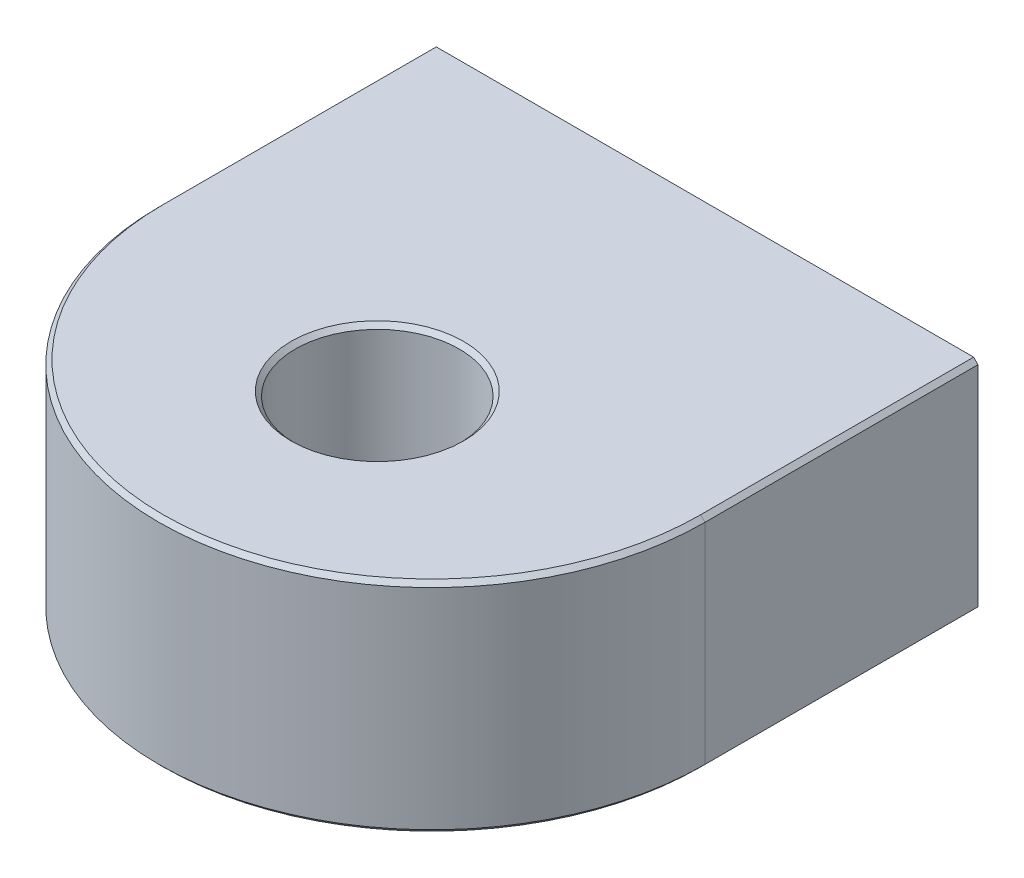
ISO-10303-21;
HEADER;
FILE_DESCRIPTION(('STEP AP214'),'2;1');
FILE_NAME('part.step','',(''),(''),'','','');
FILE_SCHEMA(('AUTOMOTIVE_DESIGN { 1 0 10303 214 1 1 1 1 }'));
ENDSEC;
DATA;
#1=APPLICATION_CONTEXT('core data for automotive mechanical design processes');
#2=APPLICATION_PROTOCOL_DEFINITION('international standard','automotive_design',2000,#1);
#3=PRODUCT_CONTEXT('',#1,'mechanical');
#4=PRODUCT('Part','Part','',(#3));
#5=PRODUCT_RELATED_PRODUCT_CATEGORY('part','',(#4));
#6=PRODUCT_DEFINITION_FORMATION('','',#4);
#7=PRODUCT_DEFINITION_CONTEXT('part definition',#1,'design');
#8=PRODUCT_DEFINITION('design','',#6,#7);
#9=PRODUCT_DEFINITION_SHAPE('','',#8);
#10=(LENGTH_UNIT() NAMED_UNIT(*) SI_UNIT(.MILLI.,.METRE.));
#11=(NAMED_UNIT(*) PLANE_ANGLE_UNIT() SI_UNIT($,.RADIAN.));
#12=(NAMED_UNIT(*) SI_UNIT($,.STERADIAN.) SOLID_ANGLE_UNIT());
#13=UNCERTAINTY_MEASURE_WITH_UNIT(LENGTH_MEASURE(1.E-05),#10,'distance_accuracy_value','');
#14=(GEOMETRIC_REPRESENTATION_CONTEXT(3) GLOBAL_UNCERTAINTY_ASSIGNED_CONTEXT((#13)) GLOBAL_UNIT_ASSIGNED_CONTEXT((#10,
#11,#12)) REPRESENTATION_CONTEXT('',''));
#15=CARTESIAN_POINT('',(0.,0.,0.));
#16=DIRECTION('',(0.,0.,1.));
#17=DIRECTION('',(1.,0.,0.));
#18=AXIS2_PLACEMENT_3D('',#15,#16,#17);
#19=CARTESIAN_POINT('',(15.875,6.35,4.7625));
#20=DIRECTION('',(0.,0.,-1.));
#21=DIRECTION('',(-1.,0.,0.));
#22=AXIS2_PLACEMENT_3D('',#19,#20,#21);
#23=PLANE('',#22);
#24=CARTESIAN_POINT('',(15.875,6.35,4.7625));
#25=DIRECTION('',(0.,0.,-1.));
#26=DIRECTION('',(-1.,0.,0.));
#27=AXIS2_PLACEMENT_3D('',#24,#25,#26);
#28=CIRCLE('',#27,4.7625);
#29=CARTESIAN_POINT('',(11.1125,6.35,4.7625));
#30=VERTEX_POINT('',#29);
#31=EDGE_CURVE('E19',#30,#30,#28,.T.);
#32=ORIENTED_EDGE('',*,*,#31,.T.);
#33=EDGE_LOOP('',(#32));
#34=FACE_BOUND('',#33,.T.);
#35=ADVANCED_FACE('F16',(#34),#23,.T.);
#36=CARTESIAN_POINT('',(5.207,6.35,19.05));
#37=DIRECTION('',(0.,0.,-1.));
#38=DIRECTION('',(-1.,0.,0.));
#39=AXIS2_PLACEMENT_3D('',#36,#37,#38);
#40=PLANE('',#39);
#41=CARTESIAN_POINT('',(5.207,6.35,19.05));
#42=DIRECTION('',(0.,0.,-1.));
#43=DIRECTION('',(-1.,0.,0.));
#44=AXIS2_PLACEMENT_3D('',#41,#42,#43);
#45=CIRCLE('',#44,2.0193);
#46=CARTESIAN_POINT('',(3.18769999999999,6.35,19.05));
#47=VERTEX_POINT('',#46);
#48=EDGE_CURVE('E123',#47,#47,#45,.T.);
#49=ORIENTED_EDGE('',*,*,#48,.T.);
#50=EDGE_LOOP('',(#49));
#51=FACE_BOUND('',#50,.T.);
#52=ADVANCED_FACE('F202',(#51),#40,.T.);
#53=CARTESIAN_POINT('',(26.543,6.35,19.05));
#54=DIRECTION('',(0.,0.,-1.));
#55=DIRECTION('',(-1.,0.,0.));
#56=AXIS2_PLACEMENT_3D('',#53,#54,#55);
#57=PLANE('',#56);
#58=CARTESIAN_POINT('',(26.543,6.35,19.05));
#59=DIRECTION('',(0.,0.,-1.));
#60=DIRECTION('',(-1.,0.,0.));
#61=AXIS2_PLACEMENT_3D('',#58,#59,#60);
#62=CIRCLE('',#61,2.0193);
#63=CARTESIAN_POINT('',(24.5237,6.35,19.05));
#64=VERTEX_POINT('',#63);
#65=EDGE_CURVE('E73',#64,#64,#62,.T.);
#66=ORIENTED_EDGE('',*,*,#65,.T.);
#67=EDGE_LOOP('',(#66));
#68=FACE_BOUND('',#67,.T.);
#69=ADVANCED_FACE('F199',(#68),#57,.T.);
#70=CARTESIAN_POINT('',(15.875,12.6999999999953,19.05));
#71=DIRECTION('',(0.,1.,0.));
#72=DIRECTION('',(0.,0.,1.));
#73=AXIS2_PLACEMENT_3D('',#70,#71,#72);
#74=CONICAL_SURFACE('',#73,5.0164999999467,0.785398163397448);
#75=CARTESIAN_POINT('',(15.875,12.6999999999953,19.05));
#76=DIRECTION('',(0.,1.,0.));
#77=DIRECTION('',(0.,0.,1.));
#78=AXIS2_PLACEMENT_3D('',#75,#76,#77);
#79=CIRCLE('',#78,5.0164999999467);
#80=CARTESIAN_POINT('',(15.875,12.6999999999953,24.0664999999467));
#81=VERTEX_POINT('',#80);
#82=EDGE_CURVE('E118',#81,#81,#79,.T.);
#83=ORIENTED_EDGE('',*,*,#82,.T.);
#84=EDGE_LOOP('',(#83));
#85=FACE_BOUND('',#84,.T.);
#86=CARTESIAN_POINT('',(15.875,12.446,19.05));
#87=DIRECTION('',(0.,1.,0.));
#88=DIRECTION('',(0.,0.,1.));
#89=AXIS2_PLACEMENT_3D('',#86,#87,#88);
#90=CIRCLE('',#89,4.7625);
#91=CARTESIAN_POINT('',(15.875,12.446,23.8125));
#92=VERTEX_POINT('',#91);
#93=EDGE_CURVE('E97',#92,#92,#90,.F.);
#94=ORIENTED_EDGE('',*,*,#93,.T.);
#95=EDGE_LOOP('',(#94));
#96=FACE_BOUND('',#95,.T.);
#97=ADVANCED_FACE('F201',(#85,#96),#74,.F.);
#98=CARTESIAN_POINT('',(31.75,12.446,0.));
#99=DIRECTION('',(0.707106781186557,0.707106781186538,0.));
#100=DIRECTION('',(-0.707106781186538,0.707106781186557,0.));
#101=AXIS2_PLACEMENT_3D('',#98,#99,#100);
#102=PLANE('',#101);
#103=DIRECTION('',(-0.707106781186538,0.707106781186557,0.));
#104=VECTOR('',#103,1.);
#105=CARTESIAN_POINT('',(31.496,12.7,15.875));
#106=LINE('',#105,#104);
#107=CARTESIAN_POINT('',(31.75,12.446,15.875));
#108=VERTEX_POINT('',#107);
#109=CARTESIAN_POINT('',(31.496,12.7,15.875));
#110=VERTEX_POINT('',#109);
#111=EDGE_CURVE('E69',#108,#110,#106,.T.);
#112=ORIENTED_EDGE('',*,*,#111,.F.);
#113=DIRECTION('',(0.,0.,-1.));
#114=VECTOR('',#113,1.);
#115=CARTESIAN_POINT('',(31.75,12.446,0.));
#116=LINE('',#115,#114);
#117=CARTESIAN_POINT('',(31.75,12.446,0.));
#118=VERTEX_POINT('',#117);
#119=EDGE_CURVE('E120',#118,#108,#116,.F.);
#120=ORIENTED_EDGE('',*,*,#119,.F.);
#121=DIRECTION('',(-0.707106781186538,0.707106781186557,0.));
#122=VECTOR('',#121,1.);
#123=CARTESIAN_POINT('',(31.75,12.446,0.));
#124=LINE('',#123,#122);
#125=CARTESIAN_POINT('',(31.496,12.7,0.));
#126=VERTEX_POINT('',#125);
#127=EDGE_CURVE('E72',#118,#126,#124,.T.);
#128=ORIENTED_EDGE('',*,*,#127,.T.);
#129=DIRECTION('',(0.,0.,-1.));
#130=VECTOR('',#129,1.);
#131=CARTESIAN_POINT('',(31.496,12.7,0.));
#132=LINE('',#131,#130);
#133=EDGE_CURVE('E59',#126,#110,#132,.F.);
#134=ORIENTED_EDGE('',*,*,#133,.T.);
#135=EDGE_LOOP('',(#112,#120,#128,#134));
#136=FACE_BOUND('',#135,.T.);
#137=ADVANCED_FACE('F67',(#136),#102,.T.);
#138=CARTESIAN_POINT('',(15.875,12.446,15.875));
#139=DIRECTION('',(0.,-1.,0.));
#140=DIRECTION('',(0.,0.,-1.));
#141=AXIS2_PLACEMENT_3D('',#138,#139,#140);
#142=CONICAL_SURFACE('',#141,15.875,0.785398163397442);
#143=DIRECTION('',(-0.707106781186541,-0.707106781186554,0.));
#144=VECTOR('',#143,1.);
#145=CARTESIAN_POINT('',(0.,12.446,15.875));
#146=LINE('',#145,#144);
#147=CARTESIAN_POINT('',(0.,12.446,15.875));
#148=VERTEX_POINT('',#147);
#149=CARTESIAN_POINT('',(0.253999999999989,12.7,15.875));
#150=VERTEX_POINT('',#149);
#151=EDGE_CURVE('E78',#148,#150,#146,.F.);
#152=ORIENTED_EDGE('',*,*,#151,.F.);
#153=CARTESIAN_POINT('',(15.875,12.446,15.875));
#154=DIRECTION('',(0.,-1.,0.));
#155=DIRECTION('',(0.,0.,-1.));
#156=AXIS2_PLACEMENT_3D('',#153,#154,#155);
#157=CIRCLE('',#156,15.875);
#158=EDGE_CURVE('E77',#108,#148,#157,.T.);
#159=ORIENTED_EDGE('',*,*,#158,.F.);
#160=ORIENTED_EDGE('',*,*,#111,.T.);
#161=CARTESIAN_POINT('',(15.875,12.7,15.875));
#162=DIRECTION('',(0.,-1.,0.));
#163=DIRECTION('',(0.,0.,-1.));
#164=AXIS2_PLACEMENT_3D('',#161,#162,#163);
#165=CIRCLE('',#164,15.621);
#166=EDGE_CURVE('E47',#110,#150,#165,.T.);
#167=ORIENTED_EDGE('',*,*,#166,.T.);
#168=EDGE_LOOP('',(#152,#159,#160,#167));
#169=FACE_BOUND('',#168,.T.);
#170=ADVANCED_FACE('F75',(#169),#142,.T.);
#171=CARTESIAN_POINT('',(0.,12.446,31.75));
#172=DIRECTION('',(-0.707106781186554,0.707106781186541,0.));
#173=DIRECTION('',(-0.707106781186541,-0.707106781186554,0.));
#174=AXIS2_PLACEMENT_3D('',#171,#172,#173);
#175=PLANE('',#174);
#176=DIRECTION('',(-0.707106781186541,-0.707106781186554,0.));
#177=VECTOR('',#176,1.);
#178=CARTESIAN_POINT('',(0.,12.446,0.));
#179=LINE('',#178,#177);
#180=CARTESIAN_POINT('',(0.253999999999991,12.7,0.));
#181=VERTEX_POINT('',#180);
#182=CARTESIAN_POINT('',(0.,12.446,0.));
#183=VERTEX_POINT('',#182);
#184=EDGE_CURVE('E80',#181,#183,#179,.T.);
#185=ORIENTED_EDGE('',*,*,#184,.T.);
#186=DIRECTION('',(0.,0.,1.));
#187=VECTOR('',#186,1.);
#188=CARTESIAN_POINT('',(0.,12.446,31.75));
#189=LINE('',#188,#187);
#190=EDGE_CURVE('E224',#148,#183,#189,.F.);
#191=ORIENTED_EDGE('',*,*,#190,.F.);
#192=ORIENTED_EDGE('',*,*,#151,.T.);
#193=DIRECTION('',(0.,0.,-1.));
#194=VECTOR('',#193,1.);
#195=CARTESIAN_POINT('',(0.253999999999991,12.7,0.));
#196=LINE('',#195,#194);
#197=EDGE_CURVE('E62',#150,#181,#196,.T.);
#198=ORIENTED_EDGE('',*,*,#197,.T.);
#199=EDGE_LOOP('',(#185,#191,#192,#198));
#200=FACE_BOUND('',#199,.T.);
#201=ADVANCED_FACE('F145',(#200),#175,.T.);
#202=CARTESIAN_POINT('',(15.875,0.,19.05));
#203=DIRECTION('',(0.,1.,0.));
#204=DIRECTION('',(0.,0.,1.));
#205=AXIS2_PLACEMENT_3D('',#202,#203,#204);
#206=CYLINDRICAL_SURFACE('',#205,4.7625);
#207=CARTESIAN_POINT('',(15.875,0.253999999983989,19.05));
#208=DIRECTION('',(0.,-1.,0.));
#209=DIRECTION('',(0.,0.,-1.));
#210=AXIS2_PLACEMENT_3D('',#207,#208,#209);
#211=CIRCLE('',#210,4.76250000003374);
#212=CARTESIAN_POINT('',(15.875,0.253999999983989,14.2874999999663));
#213=VERTEX_POINT('',#212);
#214=EDGE_CURVE('E117',#213,#213,#211,.T.);
#215=ORIENTED_EDGE('',*,*,#214,.T.);
#216=EDGE_LOOP('',(#215));
#217=FACE_BOUND('',#216,.T.);
#218=ORIENTED_EDGE('',*,*,#93,.F.);
#219=EDGE_LOOP('',(#218));
#220=FACE_BOUND('',#219,.T.);
#221=ADVANCED_FACE('F134',(#217,#220),#206,.F.);
#222=CARTESIAN_POINT('',(15.875,6.35,4.7625));
#223=DIRECTION('',(0.,0.,-1.));
#224=DIRECTION('',(-1.,0.,0.));
#225=AXIS2_PLACEMENT_3D('',#222,#223,#224);
#226=CYLINDRICAL_SURFACE('',#225,4.7625);
#227=CARTESIAN_POINT('',(15.875,6.35,0.));
#228=DIRECTION('',(0.,0.,-1.));
#229=DIRECTION('',(-1.,0.,0.));
#230=AXIS2_PLACEMENT_3D('',#227,#228,#229);
#231=CIRCLE('',#230,4.7625);
#232=CARTESIAN_POINT('',(11.1125,6.35,0.));
#233=VERTEX_POINT('',#232);
#234=EDGE_CURVE('E114',#233,#233,#231,.F.);
#235=ORIENTED_EDGE('',*,*,#234,.F.);
#236=EDGE_LOOP('',(#235));
#237=FACE_BOUND('',#236,.T.);
#238=ORIENTED_EDGE('',*,*,#31,.F.);
#239=EDGE_LOOP('',(#238));
#240=FACE_BOUND('',#239,.T.);
#241=ADVANCED_FACE('F131',(#237,#240),#226,.F.);
#242=CARTESIAN_POINT('',(5.207,6.35,19.05));
#243=DIRECTION('',(0.,0.,-1.));
#244=DIRECTION('',(-1.,0.,0.));
#245=AXIS2_PLACEMENT_3D('',#242,#243,#244);
#246=CYLINDRICAL_SURFACE('',#245,2.0193);
#247=CARTESIAN_POINT('',(5.207,6.35,0.));
#248=DIRECTION('',(0.,0.,-1.));
#249=DIRECTION('',(-1.,0.,0.));
#250=AXIS2_PLACEMENT_3D('',#247,#248,#249);
#251=CIRCLE('',#250,2.0193);
#252=CARTESIAN_POINT('',(3.18769999999999,6.35,0.));
#253=VERTEX_POINT('',#252);
#254=EDGE_CURVE('E111',#253,#253,#251,.F.);
#255=ORIENTED_EDGE('',*,*,#254,.F.);
#256=EDGE_LOOP('',(#255));
#257=FACE_BOUND('',#256,.T.);
#258=ORIENTED_EDGE('',*,*,#48,.F.);
#259=EDGE_LOOP('',(#258));
#260=FACE_BOUND('',#259,.T.);
#261=ADVANCED_FACE('F133',(#257,#260),#246,.F.);
#262=CARTESIAN_POINT('',(26.543,6.35,19.05));
#263=DIRECTION('',(0.,0.,-1.));
#264=DIRECTION('',(-1.,0.,0.));
#265=AXIS2_PLACEMENT_3D('',#262,#263,#264);
#266=CYLINDRICAL_SURFACE('',#265,2.0193);
#267=CARTESIAN_POINT('',(26.543,6.35,0.));
#268=DIRECTION('',(0.,0.,-1.));
#269=DIRECTION('',(-1.,0.,0.));
#270=AXIS2_PLACEMENT_3D('',#267,#268,#269);
#271=CIRCLE('',#270,2.0193);
#272=CARTESIAN_POINT('',(24.5237,6.35,0.));
#273=VERTEX_POINT('',#272);
#274=EDGE_CURVE('E107',#273,#273,#271,.F.);
#275=ORIENTED_EDGE('',*,*,#274,.F.);
#276=EDGE_LOOP('',(#275));
#277=FACE_BOUND('',#276,.T.);
#278=ORIENTED_EDGE('',*,*,#65,.F.);
#279=EDGE_LOOP('',(#278));
#280=FACE_BOUND('',#279,.T.);
#281=ADVANCED_FACE('F142',(#277,#280),#266,.F.);
#282=CARTESIAN_POINT('',(0.,12.7,0.));
#283=DIRECTION('',(0.,-1.,0.));
#284=DIRECTION('',(0.,0.,-1.));
#285=AXIS2_PLACEMENT_3D('',#282,#283,#284);
#286=PLANE('',#285);
#287=ORIENTED_EDGE('',*,*,#82,.F.);
#288=EDGE_LOOP('',(#287));
#289=FACE_BOUND('',#288,.T.);
#290=ORIENTED_EDGE('',*,*,#197,.F.);
#291=ORIENTED_EDGE('',*,*,#166,.F.);
#292=ORIENTED_EDGE('',*,*,#133,.F.);
#293=DIRECTION('',(-1.,0.,0.));
#294=VECTOR('',#293,1.);
#295=CARTESIAN_POINT('',(0.,12.7,0.));
#296=LINE('',#295,#294);
#297=EDGE_CURVE('E91',#181,#126,#296,.F.);
#298=ORIENTED_EDGE('',*,*,#297,.F.);
#299=EDGE_LOOP('',(#290,#291,#292,#298));
#300=FACE_BOUND('',#299,.T.);
#301=ADVANCED_FACE('F56',(#289,#300),#286,.F.);
#302=CARTESIAN_POINT('',(31.75,12.7,0.));
#303=DIRECTION('',(1.,0.,0.));
#304=DIRECTION('',(0.,0.,-1.));
#305=AXIS2_PLACEMENT_3D('',#302,#303,#304);
#306=PLANE('',#305);
#307=DIRECTION('',(0.,1.,0.));
#308=VECTOR('',#307,1.);
#309=CARTESIAN_POINT('',(31.75,12.7,0.));
#310=LINE('',#309,#308);
#311=CARTESIAN_POINT('',(31.75,0.254000000000004,0.));
#312=VERTEX_POINT('',#311);
#313=EDGE_CURVE('E110',#118,#312,#310,.F.);
#314=ORIENTED_EDGE('',*,*,#313,.F.);
#315=ORIENTED_EDGE('',*,*,#119,.T.);
#316=DIRECTION('',(0.,-1.,0.));
#317=VECTOR('',#316,1.);
#318=CARTESIAN_POINT('',(31.75,12.7,15.875));
#319=LINE('',#318,#317);
#320=CARTESIAN_POINT('',(31.75,0.254000000000004,15.875));
#321=VERTEX_POINT('',#320);
#322=EDGE_CURVE('E264',#321,#108,#319,.F.);
#323=ORIENTED_EDGE('',*,*,#322,.F.);
#324=DIRECTION('',(0.,0.,1.));
#325=VECTOR('',#324,1.);
#326=CARTESIAN_POINT('',(31.75,0.254000000000004,0.));
#327=LINE('',#326,#325);
#328=EDGE_CURVE('E93',#321,#312,#327,.F.);
#329=ORIENTED_EDGE('',*,*,#328,.T.);
#330=EDGE_LOOP('',(#314,#315,#323,#329));
#331=FACE_BOUND('',#330,.T.);
#332=ADVANCED_FACE('F183',(#331),#306,.T.);
#333=CARTESIAN_POINT('',(15.875,12.7,15.875));
#334=DIRECTION('',(0.,-1.,0.));
#335=DIRECTION('',(0.,0.,-1.));
#336=AXIS2_PLACEMENT_3D('',#333,#334,#335);
#337=CYLINDRICAL_SURFACE('',#336,15.875);
#338=CARTESIAN_POINT('',(15.875,0.254000000000003,15.875));
#339=DIRECTION('',(0.,1.,0.));
#340=DIRECTION('',(0.,0.,1.));
#341=AXIS2_PLACEMENT_3D('',#338,#339,#340);
#342=CIRCLE('',#341,15.875);
#343=CARTESIAN_POINT('',(0.,0.254000000000003,15.875));
#344=VERTEX_POINT('',#343);
#345=EDGE_CURVE('E253',#321,#344,#342,.F.);
#346=ORIENTED_EDGE('',*,*,#345,.F.);
#347=ORIENTED_EDGE('',*,*,#322,.T.);
#348=ORIENTED_EDGE('',*,*,#158,.T.);
#349=DIRECTION('',(0.,1.,0.));
#350=VECTOR('',#349,1.);
#351=CARTESIAN_POINT('',(0.,12.7,15.875));
#352=LINE('',#351,#350);
#353=EDGE_CURVE('E235',#344,#148,#352,.T.);
#354=ORIENTED_EDGE('',*,*,#353,.F.);
#355=EDGE_LOOP('',(#346,#347,#348,#354));
#356=FACE_BOUND('',#355,.T.);
#357=ADVANCED_FACE('F179',(#356),#337,.T.);
#358=CARTESIAN_POINT('',(0.,12.7,31.75));
#359=DIRECTION('',(-1.,0.,0.));
#360=DIRECTION('',(0.,0.,1.));
#361=AXIS2_PLACEMENT_3D('',#358,#359,#360);
#362=PLANE('',#361);
#363=ORIENTED_EDGE('',*,*,#353,.T.);
#364=ORIENTED_EDGE('',*,*,#190,.T.);
#365=DIRECTION('',(0.,1.,0.));
#366=VECTOR('',#365,1.);
#367=CARTESIAN_POINT('',(0.,12.7,0.));
#368=LINE('',#367,#366);
#369=CARTESIAN_POINT('',(0.,0.254000000000004,0.));
#370=VERTEX_POINT('',#369);
#371=EDGE_CURVE('E94',#370,#183,#368,.T.);
#372=ORIENTED_EDGE('',*,*,#371,.F.);
#373=DIRECTION('',(0.,0.,1.));
#374=VECTOR('',#373,1.);
#375=CARTESIAN_POINT('',(0.,0.254000000000004,0.));
#376=LINE('',#375,#374);
#377=EDGE_CURVE('E250',#370,#344,#376,.T.);
#378=ORIENTED_EDGE('',*,*,#377,.T.);
#379=EDGE_LOOP('',(#363,#364,#372,#378));
#380=FACE_BOUND('',#379,.T.);
#381=ADVANCED_FACE('F175',(#380),#362,.T.);
#382=CARTESIAN_POINT('',(15.875,1.13686837721616E-10,19.05));
#383=DIRECTION('',(0.,-1.,0.));
#384=DIRECTION('',(0.,0.,-1.));
#385=AXIS2_PLACEMENT_3D('',#382,#383,#384);
#386=CONICAL_SURFACE('',#385,5.01649999996089,0.785398163509345);
#387=ORIENTED_EDGE('',*,*,#214,.F.);
#388=EDGE_LOOP('',(#387));
#389=FACE_BOUND('',#388,.T.);
#390=CARTESIAN_POINT('',(15.875,6.39384378886865E-11,19.05));
#391=DIRECTION('',(0.,-1.,0.));
#392=DIRECTION('',(0.,0.,-1.));
#393=AXIS2_PLACEMENT_3D('',#390,#391,#392);
#394=CIRCLE('',#393,5.01650000001064);
#395=CARTESIAN_POINT('',(15.875,6.39384378886865E-11,14.0334999999894));
#396=VERTEX_POINT('',#395);
#397=EDGE_CURVE('E102',#396,#396,#394,.F.);
#398=ORIENTED_EDGE('',*,*,#397,.F.);
#399=EDGE_LOOP('',(#398));
#400=FACE_BOUND('',#399,.T.);
#401=ADVANCED_FACE('F171',(#389,#400),#386,.F.);
#402=CARTESIAN_POINT('',(0.,12.7,0.));
#403=DIRECTION('',(0.,0.,-1.));
#404=DIRECTION('',(-1.,0.,0.));
#405=AXIS2_PLACEMENT_3D('',#402,#403,#404);
#406=PLANE('',#405);
#407=ORIENTED_EDGE('',*,*,#297,.T.);
#408=ORIENTED_EDGE('',*,*,#127,.F.);
#409=ORIENTED_EDGE('',*,*,#313,.T.);
#410=DIRECTION('',(-0.707106781186548,-0.707106781186548,0.));
#411=VECTOR('',#410,1.);
#412=CARTESIAN_POINT('',(31.496,0.,0.));
#413=LINE('',#412,#411);
#414=CARTESIAN_POINT('',(31.496,0.,0.));
#415=VERTEX_POINT('',#414);
#416=EDGE_CURVE('E271',#312,#415,#413,.T.);
#417=ORIENTED_EDGE('',*,*,#416,.T.);
#418=DIRECTION('',(1.,0.,0.));
#419=VECTOR('',#418,1.);
#420=CARTESIAN_POINT('',(0.,0.,0.));
#421=LINE('',#420,#419);
#422=CARTESIAN_POINT('',(0.253999999999998,0.,0.));
#423=VERTEX_POINT('',#422);
#424=EDGE_CURVE('E105',#423,#415,#421,.T.);
#425=ORIENTED_EDGE('',*,*,#424,.F.);
#426=DIRECTION('',(-0.707106781186544,0.707106781186552,0.));
#427=VECTOR('',#426,1.);
#428=CARTESIAN_POINT('',(0.253999999999998,0.,0.));
#429=LINE('',#428,#427);
#430=EDGE_CURVE('E106',#423,#370,#429,.T.);
#431=ORIENTED_EDGE('',*,*,#430,.T.);
#432=ORIENTED_EDGE('',*,*,#371,.T.);
#433=ORIENTED_EDGE('',*,*,#184,.F.);
#434=EDGE_LOOP('',(#407,#408,#409,#417,#425,#431,#432,#433));
#435=FACE_BOUND('',#434,.T.);
#436=ORIENTED_EDGE('',*,*,#274,.T.);
#437=EDGE_LOOP('',(#436));
#438=FACE_BOUND('',#437,.T.);
#439=ORIENTED_EDGE('',*,*,#254,.T.);
#440=EDGE_LOOP('',(#439));
#441=FACE_BOUND('',#440,.T.);
#442=ORIENTED_EDGE('',*,*,#234,.T.);
#443=EDGE_LOOP('',(#442));
#444=FACE_BOUND('',#443,.T.);
#445=ADVANCED_FACE('F167',(#435,#438,#441,#444),#406,.T.);
#446=CARTESIAN_POINT('',(31.496,0.,0.));
#447=DIRECTION('',(-0.707106781186548,0.707106781186548,0.));
#448=DIRECTION('',(-0.707106781186548,-0.707106781186548,0.));
#449=AXIS2_PLACEMENT_3D('',#446,#447,#448);
#450=PLANE('',#449);
#451=ORIENTED_EDGE('',*,*,#328,.F.);
#452=DIRECTION('',(-0.707106781186547,-0.707106781186548,0.));
#453=VECTOR('',#452,1.);
#454=CARTESIAN_POINT('',(31.496,0.,15.875));
#455=LINE('',#454,#453);
#456=CARTESIAN_POINT('',(31.496,0.,15.875));
#457=VERTEX_POINT('',#456);
#458=EDGE_CURVE('E258',#457,#321,#455,.F.);
#459=ORIENTED_EDGE('',*,*,#458,.F.);
#460=DIRECTION('',(0.,0.,-1.));
#461=VECTOR('',#460,1.);
#462=CARTESIAN_POINT('',(31.496,0.,0.));
#463=LINE('',#462,#461);
#464=EDGE_CURVE('E101',#415,#457,#463,.F.);
#465=ORIENTED_EDGE('',*,*,#464,.F.);
#466=ORIENTED_EDGE('',*,*,#416,.F.);
#467=EDGE_LOOP('',(#451,#459,#465,#466));
#468=FACE_BOUND('',#467,.T.);
#469=ADVANCED_FACE('F163',(#468),#450,.F.);
#470=CARTESIAN_POINT('',(15.875,0.254000000000002,15.875));
#471=DIRECTION('',(0.,1.,0.));
#472=DIRECTION('',(0.,0.,1.));
#473=AXIS2_PLACEMENT_3D('',#470,#471,#472);
#474=CONICAL_SURFACE('',#473,15.875,0.785398163397439);
#475=DIRECTION('',(-0.707106781186544,0.707106781186552,0.));
#476=VECTOR('',#475,1.);
#477=CARTESIAN_POINT('',(0.253999999999997,0.,15.875));
#478=LINE('',#477,#476);
#479=CARTESIAN_POINT('',(0.253999999999996,0.,15.875));
#480=VERTEX_POINT('',#479);
#481=EDGE_CURVE('E252',#344,#480,#478,.F.);
#482=ORIENTED_EDGE('',*,*,#481,.T.);
#483=CARTESIAN_POINT('',(15.875,0.,15.875));
#484=DIRECTION('',(0.,1.,0.));
#485=DIRECTION('',(0.,0.,1.));
#486=AXIS2_PLACEMENT_3D('',#483,#484,#485);
#487=CIRCLE('',#486,15.621);
#488=EDGE_CURVE('E25',#457,#480,#487,.F.);
#489=ORIENTED_EDGE('',*,*,#488,.F.);
#490=ORIENTED_EDGE('',*,*,#458,.T.);
#491=ORIENTED_EDGE('',*,*,#345,.T.);
#492=EDGE_LOOP('',(#482,#489,#490,#491));
#493=FACE_BOUND('',#492,.T.);
#494=ADVANCED_FACE('F156',(#493),#474,.T.);
#495=CARTESIAN_POINT('',(0.253999999999998,0.,0.));
#496=DIRECTION('',(0.707106781186552,0.707106781186544,0.));
#497=DIRECTION('',(-0.707106781186544,0.707106781186552,0.));
#498=AXIS2_PLACEMENT_3D('',#495,#496,#497);
#499=PLANE('',#498);
#500=DIRECTION('',(0.,0.,-1.));
#501=VECTOR('',#500,1.);
#502=CARTESIAN_POINT('',(0.253999999999998,0.,0.));
#503=LINE('',#502,#501);
#504=EDGE_CURVE('E11',#480,#423,#503,.T.);
#505=ORIENTED_EDGE('',*,*,#504,.F.);
#506=ORIENTED_EDGE('',*,*,#481,.F.);
#507=ORIENTED_EDGE('',*,*,#377,.F.);
#508=ORIENTED_EDGE('',*,*,#430,.F.);
#509=EDGE_LOOP('',(#505,#506,#507,#508));
#510=FACE_BOUND('',#509,.T.);
#511=ADVANCED_FACE('F151',(#510),#499,.F.);
#512=CARTESIAN_POINT('',(0.,0.,0.));
#513=DIRECTION('',(0.,-1.,0.));
#514=DIRECTION('',(0.,0.,-1.));
#515=AXIS2_PLACEMENT_3D('',#512,#513,#514);
#516=PLANE('',#515);
#517=ORIENTED_EDGE('',*,*,#488,.T.);
#518=ORIENTED_EDGE('',*,*,#504,.T.);
#519=ORIENTED_EDGE('',*,*,#424,.T.);
#520=ORIENTED_EDGE('',*,*,#464,.T.);
#521=EDGE_LOOP('',(#517,#518,#519,#520));
#522=FACE_BOUND('',#521,.T.);
#523=ORIENTED_EDGE('',*,*,#397,.T.);
#524=EDGE_LOOP('',(#523));
#525=FACE_BOUND('',#524,.T.);
#526=ADVANCED_FACE('F149',(#522,#525),#516,.T.);
#527=CLOSED_SHELL('',(#35,#52,#69,#97,#137,#170,#201,#221,#241,#261,#281,#301,#332,#357,#381,
#401,#445,#469,#494,#511,#526));
#528=MANIFOLD_SOLID_BREP('B1',#527);
#529=ADVANCED_BREP_SHAPE_REPRESENTATION('',(#18,#528),#14);
#530=SHAPE_DEFINITION_REPRESENTATION(#9,#529);
ENDSEC;
END-ISO-10303-21;
